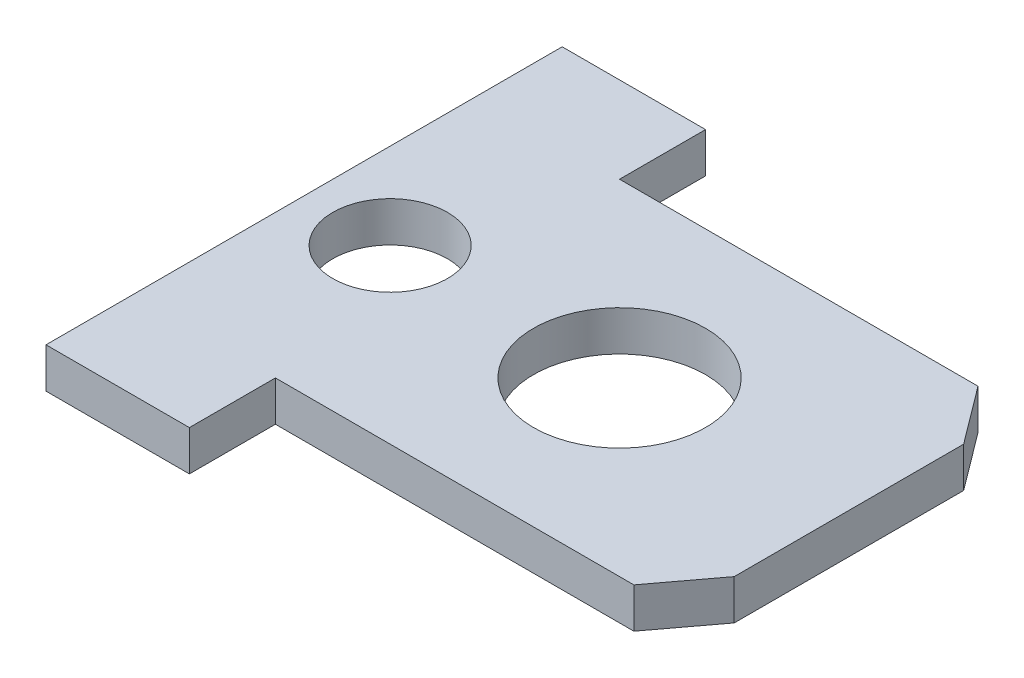
ISO-10303-21;
HEADER;
FILE_DESCRIPTION(('STEP AP214'),'2;1');
FILE_NAME('part.step','',(''),(''),'','','');
FILE_SCHEMA(('AUTOMOTIVE_DESIGN { 1 0 10303 214 1 1 1 1 }'));
ENDSEC;
DATA;
#1=APPLICATION_CONTEXT('core data for automotive mechanical design processes');
#2=APPLICATION_PROTOCOL_DEFINITION('international standard','automotive_design',2000,#1);
#3=PRODUCT_CONTEXT('',#1,'mechanical');
#4=PRODUCT('Part','Part','',(#3));
#5=PRODUCT_RELATED_PRODUCT_CATEGORY('part','',(#4));
#6=PRODUCT_DEFINITION_FORMATION('','',#4);
#7=PRODUCT_DEFINITION_CONTEXT('part definition',#1,'design');
#8=PRODUCT_DEFINITION('design','',#6,#7);
#9=PRODUCT_DEFINITION_SHAPE('','',#8);
#10=(LENGTH_UNIT() NAMED_UNIT(*) SI_UNIT(.MILLI.,.METRE.));
#11=(NAMED_UNIT(*) PLANE_ANGLE_UNIT() SI_UNIT($,.RADIAN.));
#12=(NAMED_UNIT(*) SI_UNIT($,.STERADIAN.) SOLID_ANGLE_UNIT());
#13=UNCERTAINTY_MEASURE_WITH_UNIT(LENGTH_MEASURE(1.E-05),#10,'distance_accuracy_value','');
#14=(GEOMETRIC_REPRESENTATION_CONTEXT(3) GLOBAL_UNCERTAINTY_ASSIGNED_CONTEXT((#13)) GLOBAL_UNIT_ASSIGNED_CONTEXT((#10,
#11,#12)) REPRESENTATION_CONTEXT('',''));
#15=CARTESIAN_POINT('',(0.,0.,0.));
#16=DIRECTION('',(0.,0.,1.));
#17=DIRECTION('',(1.,0.,0.));
#18=AXIS2_PLACEMENT_3D('',#15,#16,#17);
#19=CARTESIAN_POINT('',(16.,91.85,102.5));
#20=DIRECTION('',(0.,1.,0.));
#21=DIRECTION('',(0.,0.,1.));
#22=AXIS2_PLACEMENT_3D('',#19,#20,#21);
#23=PLANE('',#22);
#24=CARTESIAN_POINT('',(21.5,91.85,102.5));
#25=DIRECTION('',(0.,-1.,0.));
#26=DIRECTION('',(0.,0.,-1.));
#27=AXIS2_PLACEMENT_3D('',#24,#25,#26);
#28=CIRCLE('',#27,1.5);
#29=CARTESIAN_POINT('',(21.5,91.85,101.));
#30=VERTEX_POINT('',#29);
#31=EDGE_CURVE('E121',#30,#30,#28,.T.);
#32=ORIENTED_EDGE('',*,*,#31,.T.);
#33=EDGE_LOOP('',(#32));
#34=FACE_BOUND('',#33,.T.);
#35=CARTESIAN_POINT('',(17.5,91.85,102.5));
#36=DIRECTION('',(0.,-1.,0.));
#37=DIRECTION('',(0.,0.,-1.));
#38=AXIS2_PLACEMENT_3D('',#35,#36,#37);
#39=CIRCLE('',#38,1.);
#40=CARTESIAN_POINT('',(17.5,91.85,101.5));
#41=VERTEX_POINT('',#40);
#42=EDGE_CURVE('E20',#41,#41,#39,.T.);
#43=ORIENTED_EDGE('',*,*,#42,.T.);
#44=EDGE_LOOP('',(#43));
#45=FACE_BOUND('',#44,.T.);
#46=DIRECTION('',(0.,0.,-1.));
#47=VECTOR('',#46,1.);
#48=CARTESIAN_POINT('',(18.5,91.85,102.));
#49=LINE('',#48,#47);
#50=CARTESIAN_POINT('',(18.5,91.85,105.5));
#51=VERTEX_POINT('',#50);
#52=CARTESIAN_POINT('',(18.5,91.85,107.));
#53=VERTEX_POINT('',#52);
#54=EDGE_CURVE('E156',#51,#53,#49,.F.);
#55=ORIENTED_EDGE('',*,*,#54,.F.);
#56=DIRECTION('',(1.,0.,0.));
#57=VECTOR('',#56,1.);
#58=CARTESIAN_POINT('',(16.,91.85,105.5));
#59=LINE('',#58,#57);
#60=CARTESIAN_POINT('',(24.75,91.85,105.5));
#61=VERTEX_POINT('',#60);
#62=EDGE_CURVE('E158',#61,#51,#59,.F.);
#63=ORIENTED_EDGE('',*,*,#62,.F.);
#64=DIRECTION('',(0.6,0.,-0.8));
#65=VECTOR('',#64,1.);
#66=CARTESIAN_POINT('',(25.125,91.85,105.));
#67=LINE('',#66,#65);
#68=CARTESIAN_POINT('',(25.5,91.85,104.5));
#69=VERTEX_POINT('',#68);
#70=EDGE_CURVE('E167',#69,#61,#67,.F.);
#71=ORIENTED_EDGE('',*,*,#70,.F.);
#72=DIRECTION('',(0.,0.,-1.));
#73=VECTOR('',#72,1.);
#74=CARTESIAN_POINT('',(25.5,91.85,102.));
#75=LINE('',#74,#73);
#76=CARTESIAN_POINT('',(25.5,91.85,100.5));
#77=VERTEX_POINT('',#76);
#78=EDGE_CURVE('E99',#77,#69,#75,.F.);
#79=ORIENTED_EDGE('',*,*,#78,.F.);
#80=DIRECTION('',(-0.6,0.,-0.8));
#81=VECTOR('',#80,1.);
#82=CARTESIAN_POINT('',(25.125,91.85,100.));
#83=LINE('',#82,#81);
#84=CARTESIAN_POINT('',(24.75,91.85,99.5));
#85=VERTEX_POINT('',#84);
#86=EDGE_CURVE('E91',#85,#77,#83,.F.);
#87=ORIENTED_EDGE('',*,*,#86,.F.);
#88=DIRECTION('',(-1.,0.,0.));
#89=VECTOR('',#88,1.);
#90=CARTESIAN_POINT('',(16.,91.85,99.5));
#91=LINE('',#90,#89);
#92=CARTESIAN_POINT('',(18.5,91.85,99.5));
#93=VERTEX_POINT('',#92);
#94=EDGE_CURVE('E96',#93,#85,#91,.F.);
#95=ORIENTED_EDGE('',*,*,#94,.F.);
#96=DIRECTION('',(0.,0.,-1.));
#97=VECTOR('',#96,1.);
#98=CARTESIAN_POINT('',(18.5,91.85,102.));
#99=LINE('',#98,#97);
#100=CARTESIAN_POINT('',(18.5,91.85,98.));
#101=VERTEX_POINT('',#100);
#102=EDGE_CURVE('E130',#101,#93,#99,.F.);
#103=ORIENTED_EDGE('',*,*,#102,.F.);
#104=DIRECTION('',(-1.,0.,0.));
#105=VECTOR('',#104,1.);
#106=CARTESIAN_POINT('',(16.,91.85,98.));
#107=LINE('',#106,#105);
#108=CARTESIAN_POINT('',(16.,91.85,98.));
#109=VERTEX_POINT('',#108);
#110=EDGE_CURVE('E138',#109,#101,#107,.F.);
#111=ORIENTED_EDGE('',*,*,#110,.F.);
#112=DIRECTION('',(0.,0.,-1.));
#113=VECTOR('',#112,1.);
#114=CARTESIAN_POINT('',(16.,91.85,102.));
#115=LINE('',#114,#113);
#116=CARTESIAN_POINT('',(16.,91.85,107.));
#117=VERTEX_POINT('',#116);
#118=EDGE_CURVE('E145',#109,#117,#115,.F.);
#119=ORIENTED_EDGE('',*,*,#118,.T.);
#120=DIRECTION('',(1.,0.,0.));
#121=VECTOR('',#120,1.);
#122=CARTESIAN_POINT('',(16.,91.85,107.));
#123=LINE('',#122,#121);
#124=EDGE_CURVE('E147',#53,#117,#123,.F.);
#125=ORIENTED_EDGE('',*,*,#124,.F.);
#126=EDGE_LOOP('',(#55,#63,#71,#79,#87,#95,#103,#111,#119,#125));
#127=FACE_BOUND('',#126,.T.);
#128=ADVANCED_FACE('F17',(#34,#45,#127),#23,.T.);
#129=CARTESIAN_POINT('',(16.,91.5,99.5));
#130=DIRECTION('',(0.,0.,-1.));
#131=DIRECTION('',(-1.,0.,0.));
#132=AXIS2_PLACEMENT_3D('',#129,#130,#131);
#133=PLANE('',#132);
#134=DIRECTION('',(1.,0.,0.));
#135=VECTOR('',#134,1.);
#136=CARTESIAN_POINT('',(16.,91.15,99.5));
#137=LINE('',#136,#135);
#138=CARTESIAN_POINT('',(18.5,91.15,99.5));
#139=VERTEX_POINT('',#138);
#140=CARTESIAN_POINT('',(24.75,91.15,99.5));
#141=VERTEX_POINT('',#140);
#142=EDGE_CURVE('E123',#139,#141,#137,.T.);
#143=ORIENTED_EDGE('',*,*,#142,.F.);
#144=DIRECTION('',(0.,1.,0.));
#145=VECTOR('',#144,1.);
#146=CARTESIAN_POINT('',(18.5,91.5,99.5));
#147=LINE('',#146,#145);
#148=EDGE_CURVE('E107',#93,#139,#147,.F.);
#149=ORIENTED_EDGE('',*,*,#148,.F.);
#150=ORIENTED_EDGE('',*,*,#94,.T.);
#151=DIRECTION('',(0.,1.,0.));
#152=VECTOR('',#151,1.);
#153=CARTESIAN_POINT('',(24.75,91.15,99.5));
#154=LINE('',#153,#152);
#155=EDGE_CURVE('E101',#141,#85,#154,.T.);
#156=ORIENTED_EDGE('',*,*,#155,.F.);
#157=EDGE_LOOP('',(#143,#149,#150,#156));
#158=FACE_BOUND('',#157,.T.);
#159=ADVANCED_FACE('F104',(#158),#133,.T.);
#160=CARTESIAN_POINT('',(25.125,91.15,100.));
#161=DIRECTION('',(0.8,0.,-0.6));
#162=DIRECTION('',(-0.6,0.,-0.8));
#163=AXIS2_PLACEMENT_3D('',#160,#161,#162);
#164=PLANE('',#163);
#165=DIRECTION('',(0.6,0.,0.8));
#166=VECTOR('',#165,1.);
#167=CARTESIAN_POINT('',(24.75,91.15,99.5));
#168=LINE('',#167,#166);
#169=CARTESIAN_POINT('',(25.5,91.15,100.5));
#170=VERTEX_POINT('',#169);
#171=EDGE_CURVE('E112',#141,#170,#168,.T.);
#172=ORIENTED_EDGE('',*,*,#171,.F.);
#173=ORIENTED_EDGE('',*,*,#155,.T.);
#174=ORIENTED_EDGE('',*,*,#86,.T.);
#175=DIRECTION('',(0.,1.,0.));
#176=VECTOR('',#175,1.);
#177=CARTESIAN_POINT('',(25.5,91.5,100.5));
#178=LINE('',#177,#176);
#179=EDGE_CURVE('E114',#170,#77,#178,.T.);
#180=ORIENTED_EDGE('',*,*,#179,.F.);
#181=EDGE_LOOP('',(#172,#173,#174,#180));
#182=FACE_BOUND('',#181,.T.);
#183=ADVANCED_FACE('F110',(#182),#164,.T.);
#184=CARTESIAN_POINT('',(25.5,91.5,102.));
#185=DIRECTION('',(1.,0.,0.));
#186=DIRECTION('',(0.,0.,-1.));
#187=AXIS2_PLACEMENT_3D('',#184,#185,#186);
#188=PLANE('',#187);
#189=DIRECTION('',(0.,1.,0.));
#190=VECTOR('',#189,1.);
#191=CARTESIAN_POINT('',(25.5,91.15,104.5));
#192=LINE('',#191,#190);
#193=CARTESIAN_POINT('',(25.5,91.15,104.5));
#194=VERTEX_POINT('',#193);
#195=EDGE_CURVE('E164',#194,#69,#192,.T.);
#196=ORIENTED_EDGE('',*,*,#195,.F.);
#197=DIRECTION('',(0.,0.,-1.));
#198=VECTOR('',#197,1.);
#199=CARTESIAN_POINT('',(25.5,91.15,102.5));
#200=LINE('',#199,#198);
#201=EDGE_CURVE('E182',#170,#194,#200,.F.);
#202=ORIENTED_EDGE('',*,*,#201,.F.);
#203=ORIENTED_EDGE('',*,*,#179,.T.);
#204=ORIENTED_EDGE('',*,*,#78,.T.);
#205=EDGE_LOOP('',(#196,#202,#203,#204));
#206=FACE_BOUND('',#205,.T.);
#207=ADVANCED_FACE('F169',(#206),#188,.T.);
#208=CARTESIAN_POINT('',(25.125,91.15,105.));
#209=DIRECTION('',(0.8,0.,0.6));
#210=DIRECTION('',(0.6,0.,-0.8));
#211=AXIS2_PLACEMENT_3D('',#208,#209,#210);
#212=PLANE('',#211);
#213=DIRECTION('',(-0.6,0.,0.8));
#214=VECTOR('',#213,1.);
#215=CARTESIAN_POINT('',(25.5,91.15,104.5));
#216=LINE('',#215,#214);
#217=CARTESIAN_POINT('',(24.75,91.15,105.5));
#218=VERTEX_POINT('',#217);
#219=EDGE_CURVE('E176',#194,#218,#216,.T.);
#220=ORIENTED_EDGE('',*,*,#219,.F.);
#221=ORIENTED_EDGE('',*,*,#195,.T.);
#222=ORIENTED_EDGE('',*,*,#70,.T.);
#223=DIRECTION('',(0.,1.,0.));
#224=VECTOR('',#223,1.);
#225=CARTESIAN_POINT('',(24.75,91.5,105.5));
#226=LINE('',#225,#224);
#227=EDGE_CURVE('E161',#218,#61,#226,.T.);
#228=ORIENTED_EDGE('',*,*,#227,.F.);
#229=EDGE_LOOP('',(#220,#221,#222,#228));
#230=FACE_BOUND('',#229,.T.);
#231=ADVANCED_FACE('F173',(#230),#212,.T.);
#232=CARTESIAN_POINT('',(16.,91.5,105.5));
#233=DIRECTION('',(0.,0.,1.));
#234=DIRECTION('',(1.,0.,0.));
#235=AXIS2_PLACEMENT_3D('',#232,#233,#234);
#236=PLANE('',#235);
#237=DIRECTION('',(0.,1.,0.));
#238=VECTOR('',#237,1.);
#239=CARTESIAN_POINT('',(18.5,91.5,105.5));
#240=LINE('',#239,#238);
#241=CARTESIAN_POINT('',(18.5,91.15,105.5));
#242=VERTEX_POINT('',#241);
#243=EDGE_CURVE('E153',#242,#51,#240,.T.);
#244=ORIENTED_EDGE('',*,*,#243,.F.);
#245=DIRECTION('',(1.,0.,0.));
#246=VECTOR('',#245,1.);
#247=CARTESIAN_POINT('',(16.,91.15,105.5));
#248=LINE('',#247,#246);
#249=EDGE_CURVE('E181',#218,#242,#248,.F.);
#250=ORIENTED_EDGE('',*,*,#249,.F.);
#251=ORIENTED_EDGE('',*,*,#227,.T.);
#252=ORIENTED_EDGE('',*,*,#62,.T.);
#253=EDGE_LOOP('',(#244,#250,#251,#252));
#254=FACE_BOUND('',#253,.T.);
#255=ADVANCED_FACE('F213',(#254),#236,.T.);
#256=CARTESIAN_POINT('',(18.5,91.5,102.));
#257=DIRECTION('',(1.,0.,0.));
#258=DIRECTION('',(0.,0.,-1.));
#259=AXIS2_PLACEMENT_3D('',#256,#257,#258);
#260=PLANE('',#259);
#261=DIRECTION('',(0.,0.,-1.));
#262=VECTOR('',#261,1.);
#263=CARTESIAN_POINT('',(18.5,91.15,102.5));
#264=LINE('',#263,#262);
#265=CARTESIAN_POINT('',(18.5,91.15,107.));
#266=VERTEX_POINT('',#265);
#267=EDGE_CURVE('E189',#242,#266,#264,.F.);
#268=ORIENTED_EDGE('',*,*,#267,.F.);
#269=ORIENTED_EDGE('',*,*,#243,.T.);
#270=ORIENTED_EDGE('',*,*,#54,.T.);
#271=DIRECTION('',(0.,1.,0.));
#272=VECTOR('',#271,1.);
#273=CARTESIAN_POINT('',(18.5,91.5,107.));
#274=LINE('',#273,#272);
#275=EDGE_CURVE('E150',#266,#53,#274,.T.);
#276=ORIENTED_EDGE('',*,*,#275,.F.);
#277=EDGE_LOOP('',(#268,#269,#270,#276));
#278=FACE_BOUND('',#277,.T.);
#279=ADVANCED_FACE('F215',(#278),#260,.T.);
#280=CARTESIAN_POINT('',(16.,91.5,107.));
#281=DIRECTION('',(0.,0.,1.));
#282=DIRECTION('',(1.,0.,0.));
#283=AXIS2_PLACEMENT_3D('',#280,#281,#282);
#284=PLANE('',#283);
#285=DIRECTION('',(0.,1.,0.));
#286=VECTOR('',#285,1.);
#287=CARTESIAN_POINT('',(16.,91.5,107.));
#288=LINE('',#287,#286);
#289=CARTESIAN_POINT('',(16.,91.15,107.));
#290=VERTEX_POINT('',#289);
#291=EDGE_CURVE('E143',#117,#290,#288,.F.);
#292=ORIENTED_EDGE('',*,*,#291,.T.);
#293=DIRECTION('',(1.,0.,0.));
#294=VECTOR('',#293,1.);
#295=CARTESIAN_POINT('',(16.,91.15,107.));
#296=LINE('',#295,#294);
#297=EDGE_CURVE('E192',#266,#290,#296,.F.);
#298=ORIENTED_EDGE('',*,*,#297,.F.);
#299=ORIENTED_EDGE('',*,*,#275,.T.);
#300=ORIENTED_EDGE('',*,*,#124,.T.);
#301=EDGE_LOOP('',(#292,#298,#299,#300));
#302=FACE_BOUND('',#301,.T.);
#303=ADVANCED_FACE('F210',(#302),#284,.T.);
#304=CARTESIAN_POINT('',(16.,91.5,102.));
#305=DIRECTION('',(1.,0.,0.));
#306=DIRECTION('',(0.,0.,-1.));
#307=AXIS2_PLACEMENT_3D('',#304,#305,#306);
#308=PLANE('',#307);
#309=ORIENTED_EDGE('',*,*,#291,.F.);
#310=ORIENTED_EDGE('',*,*,#118,.F.);
#311=DIRECTION('',(0.,1.,0.));
#312=VECTOR('',#311,1.);
#313=CARTESIAN_POINT('',(16.,91.5,98.));
#314=LINE('',#313,#312);
#315=CARTESIAN_POINT('',(16.,91.15,98.));
#316=VERTEX_POINT('',#315);
#317=EDGE_CURVE('E140',#316,#109,#314,.T.);
#318=ORIENTED_EDGE('',*,*,#317,.F.);
#319=DIRECTION('',(0.,0.,-1.));
#320=VECTOR('',#319,1.);
#321=CARTESIAN_POINT('',(16.,91.15,102.5));
#322=LINE('',#321,#320);
#323=EDGE_CURVE('E195',#290,#316,#322,.T.);
#324=ORIENTED_EDGE('',*,*,#323,.F.);
#325=EDGE_LOOP('',(#309,#310,#318,#324));
#326=FACE_BOUND('',#325,.T.);
#327=ADVANCED_FACE('F207',(#326),#308,.F.);
#328=CARTESIAN_POINT('',(16.,91.5,98.));
#329=DIRECTION('',(0.,0.,-1.));
#330=DIRECTION('',(-1.,0.,0.));
#331=AXIS2_PLACEMENT_3D('',#328,#329,#330);
#332=PLANE('',#331);
#333=DIRECTION('',(0.,1.,0.));
#334=VECTOR('',#333,1.);
#335=CARTESIAN_POINT('',(18.5,91.5,98.));
#336=LINE('',#335,#334);
#337=CARTESIAN_POINT('',(18.5,91.15,98.));
#338=VERTEX_POINT('',#337);
#339=EDGE_CURVE('E35',#338,#101,#336,.T.);
#340=ORIENTED_EDGE('',*,*,#339,.F.);
#341=DIRECTION('',(1.,0.,0.));
#342=VECTOR('',#341,1.);
#343=CARTESIAN_POINT('',(16.,91.15,98.));
#344=LINE('',#343,#342);
#345=EDGE_CURVE('E198',#316,#338,#344,.T.);
#346=ORIENTED_EDGE('',*,*,#345,.F.);
#347=ORIENTED_EDGE('',*,*,#317,.T.);
#348=ORIENTED_EDGE('',*,*,#110,.T.);
#349=EDGE_LOOP('',(#340,#346,#347,#348));
#350=FACE_BOUND('',#349,.T.);
#351=ADVANCED_FACE('F203',(#350),#332,.T.);
#352=CARTESIAN_POINT('',(18.5,91.5,102.));
#353=DIRECTION('',(1.,0.,0.));
#354=DIRECTION('',(0.,0.,-1.));
#355=AXIS2_PLACEMENT_3D('',#352,#353,#354);
#356=PLANE('',#355);
#357=ORIENTED_EDGE('',*,*,#148,.T.);
#358=DIRECTION('',(0.,0.,-1.));
#359=VECTOR('',#358,1.);
#360=CARTESIAN_POINT('',(18.5,91.15,102.5));
#361=LINE('',#360,#359);
#362=EDGE_CURVE('E120',#338,#139,#361,.F.);
#363=ORIENTED_EDGE('',*,*,#362,.F.);
#364=ORIENTED_EDGE('',*,*,#339,.T.);
#365=ORIENTED_EDGE('',*,*,#102,.T.);
#366=EDGE_LOOP('',(#357,#363,#364,#365));
#367=FACE_BOUND('',#366,.T.);
#368=ADVANCED_FACE('F200',(#367),#356,.T.);
#369=CARTESIAN_POINT('',(17.5,91.15,102.5));
#370=DIRECTION('',(0.,-1.,0.));
#371=DIRECTION('',(0.,0.,-1.));
#372=AXIS2_PLACEMENT_3D('',#369,#370,#371);
#373=CYLINDRICAL_SURFACE('',#372,1.);
#374=CARTESIAN_POINT('',(17.5,91.15,102.5));
#375=DIRECTION('',(0.,-1.,0.));
#376=DIRECTION('',(0.,0.,-1.));
#377=AXIS2_PLACEMENT_3D('',#374,#375,#376);
#378=CIRCLE('',#377,1.);
#379=CARTESIAN_POINT('',(17.5,91.15,101.5));
#380=VERTEX_POINT('',#379);
#381=EDGE_CURVE('E26',#380,#380,#378,.F.);
#382=ORIENTED_EDGE('',*,*,#381,.F.);
#383=EDGE_LOOP('',(#382));
#384=FACE_BOUND('',#383,.T.);
#385=ORIENTED_EDGE('',*,*,#42,.F.);
#386=EDGE_LOOP('',(#385));
#387=FACE_BOUND('',#386,.T.);
#388=ADVANCED_FACE('F232',(#384,#387),#373,.F.);
#389=CARTESIAN_POINT('',(21.5,91.15,102.5));
#390=DIRECTION('',(0.,-1.,0.));
#391=DIRECTION('',(0.,0.,-1.));
#392=AXIS2_PLACEMENT_3D('',#389,#390,#391);
#393=CYLINDRICAL_SURFACE('',#392,1.5);
#394=CARTESIAN_POINT('',(21.5,91.15,102.5));
#395=DIRECTION('',(0.,-1.,0.));
#396=DIRECTION('',(0.,0.,-1.));
#397=AXIS2_PLACEMENT_3D('',#394,#395,#396);
#398=CIRCLE('',#397,1.5);
#399=CARTESIAN_POINT('',(21.5,91.15,101.));
#400=VERTEX_POINT('',#399);
#401=EDGE_CURVE('E11',#400,#400,#398,.F.);
#402=ORIENTED_EDGE('',*,*,#401,.F.);
#403=EDGE_LOOP('',(#402));
#404=FACE_BOUND('',#403,.T.);
#405=ORIENTED_EDGE('',*,*,#31,.F.);
#406=EDGE_LOOP('',(#405));
#407=FACE_BOUND('',#406,.T.);
#408=ADVANCED_FACE('F226',(#404,#407),#393,.F.);
#409=CARTESIAN_POINT('',(16.,91.15,102.5));
#410=DIRECTION('',(0.,-1.,0.));
#411=DIRECTION('',(0.,0.,-1.));
#412=AXIS2_PLACEMENT_3D('',#409,#410,#411);
#413=PLANE('',#412);
#414=ORIENTED_EDGE('',*,*,#401,.T.);
#415=EDGE_LOOP('',(#414));
#416=FACE_BOUND('',#415,.T.);
#417=ORIENTED_EDGE('',*,*,#381,.T.);
#418=EDGE_LOOP('',(#417));
#419=FACE_BOUND('',#418,.T.);
#420=ORIENTED_EDGE('',*,*,#345,.T.);
#421=ORIENTED_EDGE('',*,*,#362,.T.);
#422=ORIENTED_EDGE('',*,*,#142,.T.);
#423=ORIENTED_EDGE('',*,*,#171,.T.);
#424=ORIENTED_EDGE('',*,*,#201,.T.);
#425=ORIENTED_EDGE('',*,*,#219,.T.);
#426=ORIENTED_EDGE('',*,*,#249,.T.);
#427=ORIENTED_EDGE('',*,*,#267,.T.);
#428=ORIENTED_EDGE('',*,*,#297,.T.);
#429=ORIENTED_EDGE('',*,*,#323,.T.);
#430=EDGE_LOOP('',(#420,#421,#422,#423,#424,#425,#426,#427,#428,#429));
#431=FACE_BOUND('',#430,.T.);
#432=ADVANCED_FACE('F185',(#416,#419,#431),#413,.T.);
#433=CLOSED_SHELL('',(#128,#159,#183,#207,#231,#255,#279,#303,#327,#351,#368,#388,#408,#432));
#434=MANIFOLD_SOLID_BREP('B1',#433);
#435=ADVANCED_BREP_SHAPE_REPRESENTATION('',(#18,#434),#14);
#436=SHAPE_DEFINITION_REPRESENTATION(#9,#435);
ENDSEC;
END-ISO-10303-21;
